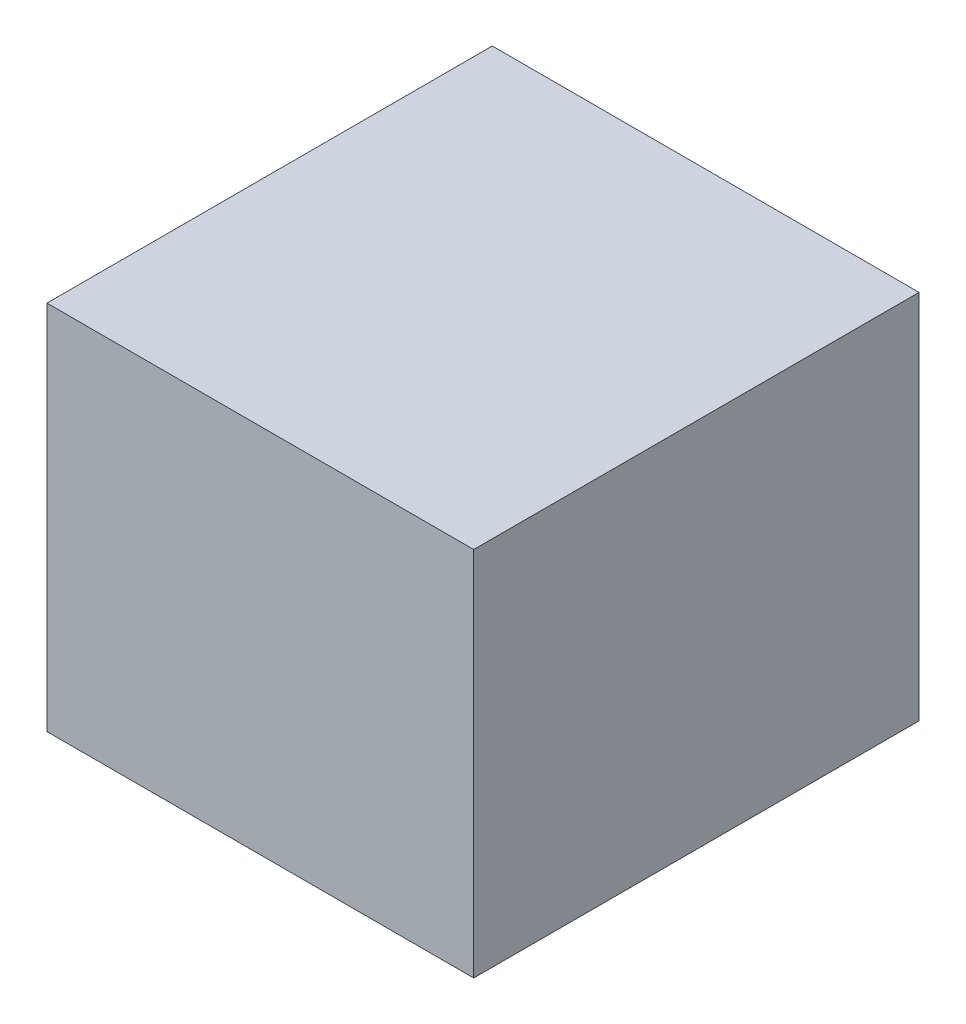
ISO-10303-21;
HEADER;
FILE_DESCRIPTION(('STEP AP214'),'2;1');
FILE_NAME('part.step','',(''),(''),'','','');
FILE_SCHEMA(('AUTOMOTIVE_DESIGN { 1 0 10303 214 1 1 1 1 }'));
ENDSEC;
DATA;
#1=APPLICATION_CONTEXT('core data for automotive mechanical design processes');
#2=APPLICATION_PROTOCOL_DEFINITION('international standard','automotive_design',2000,#1);
#3=PRODUCT_CONTEXT('',#1,'mechanical');
#4=PRODUCT('Part','Part','',(#3));
#5=PRODUCT_RELATED_PRODUCT_CATEGORY('part','',(#4));
#6=PRODUCT_DEFINITION_FORMATION('','',#4);
#7=PRODUCT_DEFINITION_CONTEXT('part definition',#1,'design');
#8=PRODUCT_DEFINITION('design','',#6,#7);
#9=PRODUCT_DEFINITION_SHAPE('','',#8);
#10=(LENGTH_UNIT() NAMED_UNIT(*) SI_UNIT(.MILLI.,.METRE.));
#11=(NAMED_UNIT(*) PLANE_ANGLE_UNIT() SI_UNIT($,.RADIAN.));
#12=(NAMED_UNIT(*) SI_UNIT($,.STERADIAN.) SOLID_ANGLE_UNIT());
#13=UNCERTAINTY_MEASURE_WITH_UNIT(LENGTH_MEASURE(1.E-05),#10,'distance_accuracy_value','');
#14=(GEOMETRIC_REPRESENTATION_CONTEXT(3) GLOBAL_UNCERTAINTY_ASSIGNED_CONTEXT((#13)) GLOBAL_UNIT_ASSIGNED_CONTEXT((#10,
#11,#12)) REPRESENTATION_CONTEXT('',''));
#15=CARTESIAN_POINT('',(0.,0.,0.));
#16=DIRECTION('',(0.,0.,1.));
#17=DIRECTION('',(1.,0.,0.));
#18=AXIS2_PLACEMENT_3D('',#15,#16,#17);
#19=CARTESIAN_POINT('',(287.5,250.,-300.));
#20=DIRECTION('',(0.,0.,1.));
#21=DIRECTION('',(0.,-1.,0.));
#22=AXIS2_PLACEMENT_3D('',#19,#20,#21);
#23=PLANE('',#22);
#24=DIRECTION('',(0.,1.,0.));
#25=VECTOR('',#24,1.);
#26=CARTESIAN_POINT('',(-287.5,250.,-300.));
#27=LINE('',#26,#25);
#28=CARTESIAN_POINT('',(-287.5,-250.,-300.));
#29=VERTEX_POINT('',#28);
#30=CARTESIAN_POINT('',(-287.5,250.,-300.));
#31=VERTEX_POINT('',#30);
#32=EDGE_CURVE('E96',#29,#31,#27,.T.);
#33=ORIENTED_EDGE('',*,*,#32,.T.);
#34=DIRECTION('',(-1.,0.,0.));
#35=VECTOR('',#34,1.);
#36=CARTESIAN_POINT('',(287.5,250.,-300.));
#37=LINE('',#36,#35);
#38=CARTESIAN_POINT('',(287.5,250.,-300.));
#39=VERTEX_POINT('',#38);
#40=EDGE_CURVE('E11',#39,#31,#37,.T.);
#41=ORIENTED_EDGE('',*,*,#40,.F.);
#42=DIRECTION('',(0.,1.,0.));
#43=VECTOR('',#42,1.);
#44=CARTESIAN_POINT('',(287.5,250.,-300.));
#45=LINE('',#44,#43);
#46=CARTESIAN_POINT('',(287.5,-250.,-300.));
#47=VERTEX_POINT('',#46);
#48=EDGE_CURVE('E84',#47,#39,#45,.T.);
#49=ORIENTED_EDGE('',*,*,#48,.F.);
#50=DIRECTION('',(-1.,0.,0.));
#51=VECTOR('',#50,1.);
#52=CARTESIAN_POINT('',(287.5,-250.,-300.));
#53=LINE('',#52,#51);
#54=EDGE_CURVE('E92',#47,#29,#53,.T.);
#55=ORIENTED_EDGE('',*,*,#54,.T.);
#56=EDGE_LOOP('',(#33,#41,#49,#55));
#57=FACE_BOUND('',#56,.T.);
#58=ADVANCED_FACE('F33',(#57),#23,.F.);
#59=CARTESIAN_POINT('',(287.5,250.,300.));
#60=DIRECTION('',(0.,-1.,0.));
#61=DIRECTION('',(0.,0.,-1.));
#62=AXIS2_PLACEMENT_3D('',#59,#60,#61);
#63=PLANE('',#62);
#64=DIRECTION('',(0.,0.,1.));
#65=VECTOR('',#64,1.);
#66=CARTESIAN_POINT('',(-287.5,250.,300.));
#67=LINE('',#66,#65);
#68=CARTESIAN_POINT('',(-287.5,250.,300.));
#69=VERTEX_POINT('',#68);
#70=EDGE_CURVE('E88',#31,#69,#67,.T.);
#71=ORIENTED_EDGE('',*,*,#70,.T.);
#72=DIRECTION('',(-1.,0.,0.));
#73=VECTOR('',#72,1.);
#74=CARTESIAN_POINT('',(287.5,250.,300.));
#75=LINE('',#74,#73);
#76=CARTESIAN_POINT('',(287.5,250.,300.));
#77=VERTEX_POINT('',#76);
#78=EDGE_CURVE('E41',#77,#69,#75,.T.);
#79=ORIENTED_EDGE('',*,*,#78,.F.);
#80=DIRECTION('',(0.,0.,1.));
#81=VECTOR('',#80,1.);
#82=CARTESIAN_POINT('',(287.5,250.,300.));
#83=LINE('',#82,#81);
#84=EDGE_CURVE('E79',#39,#77,#83,.T.);
#85=ORIENTED_EDGE('',*,*,#84,.F.);
#86=ORIENTED_EDGE('',*,*,#40,.T.);
#87=EDGE_LOOP('',(#71,#79,#85,#86));
#88=FACE_BOUND('',#87,.T.);
#89=ADVANCED_FACE('F87',(#88),#63,.F.);
#90=CARTESIAN_POINT('',(287.5,250.,300.));
#91=DIRECTION('',(0.,0.,-1.));
#92=DIRECTION('',(-1.,0.,0.));
#93=AXIS2_PLACEMENT_3D('',#90,#91,#92);
#94=PLANE('',#93);
#95=DIRECTION('',(0.,-1.,0.));
#96=VECTOR('',#95,1.);
#97=CARTESIAN_POINT('',(-287.5,250.,300.));
#98=LINE('',#97,#96);
#99=CARTESIAN_POINT('',(-287.5,-250.,300.));
#100=VERTEX_POINT('',#99);
#101=EDGE_CURVE('E66',#69,#100,#98,.T.);
#102=ORIENTED_EDGE('',*,*,#101,.T.);
#103=DIRECTION('',(-1.,0.,0.));
#104=VECTOR('',#103,1.);
#105=CARTESIAN_POINT('',(287.5,-250.,300.));
#106=LINE('',#105,#104);
#107=CARTESIAN_POINT('',(287.5,-250.,300.));
#108=VERTEX_POINT('',#107);
#109=EDGE_CURVE('E89',#108,#100,#106,.T.);
#110=ORIENTED_EDGE('',*,*,#109,.F.);
#111=DIRECTION('',(0.,-1.,0.));
#112=VECTOR('',#111,1.);
#113=CARTESIAN_POINT('',(287.5,250.,300.));
#114=LINE('',#113,#112);
#115=EDGE_CURVE('E82',#77,#108,#114,.T.);
#116=ORIENTED_EDGE('',*,*,#115,.F.);
#117=ORIENTED_EDGE('',*,*,#78,.T.);
#118=EDGE_LOOP('',(#102,#110,#116,#117));
#119=FACE_BOUND('',#118,.T.);
#120=ADVANCED_FACE('F90',(#119),#94,.F.);
#121=CARTESIAN_POINT('',(287.5,-250.,300.));
#122=DIRECTION('',(0.,1.,0.));
#123=DIRECTION('',(0.,0.,1.));
#124=AXIS2_PLACEMENT_3D('',#121,#122,#123);
#125=PLANE('',#124);
#126=DIRECTION('',(0.,0.,-1.));
#127=VECTOR('',#126,1.);
#128=CARTESIAN_POINT('',(-287.5,-250.,300.));
#129=LINE('',#128,#127);
#130=EDGE_CURVE('E72',#100,#29,#129,.T.);
#131=ORIENTED_EDGE('',*,*,#130,.T.);
#132=ORIENTED_EDGE('',*,*,#54,.F.);
#133=DIRECTION('',(0.,0.,-1.));
#134=VECTOR('',#133,1.);
#135=CARTESIAN_POINT('',(287.5,-250.,300.));
#136=LINE('',#135,#134);
#137=EDGE_CURVE('E49',#108,#47,#136,.T.);
#138=ORIENTED_EDGE('',*,*,#137,.F.);
#139=ORIENTED_EDGE('',*,*,#109,.T.);
#140=EDGE_LOOP('',(#131,#132,#138,#139));
#141=FACE_BOUND('',#140,.T.);
#142=ADVANCED_FACE('F103',(#141),#125,.F.);
#143=CARTESIAN_POINT('',(287.5,0.,0.));
#144=DIRECTION('',(1.,0.,0.));
#145=DIRECTION('',(0.,0.,-1.));
#146=AXIS2_PLACEMENT_3D('',#143,#144,#145);
#147=PLANE('',#146);
#148=ORIENTED_EDGE('',*,*,#48,.T.);
#149=ORIENTED_EDGE('',*,*,#84,.T.);
#150=ORIENTED_EDGE('',*,*,#115,.T.);
#151=ORIENTED_EDGE('',*,*,#137,.T.);
#152=EDGE_LOOP('',(#148,#149,#150,#151));
#153=FACE_BOUND('',#152,.T.);
#154=ADVANCED_FACE('F80',(#153),#147,.T.);
#155=CARTESIAN_POINT('',(-287.5,0.,0.));
#156=DIRECTION('',(1.,0.,0.));
#157=DIRECTION('',(0.,0.,-1.));
#158=AXIS2_PLACEMENT_3D('',#155,#156,#157);
#159=PLANE('',#158);
#160=ORIENTED_EDGE('',*,*,#32,.F.);
#161=ORIENTED_EDGE('',*,*,#130,.F.);
#162=ORIENTED_EDGE('',*,*,#101,.F.);
#163=ORIENTED_EDGE('',*,*,#70,.F.);
#164=EDGE_LOOP('',(#160,#161,#162,#163));
#165=FACE_BOUND('',#164,.T.);
#166=ADVANCED_FACE('F106',(#165),#159,.F.);
#167=CLOSED_SHELL('',(#58,#89,#120,#142,#154,#166));
#168=MANIFOLD_SOLID_BREP('B2',#167);
#169=ADVANCED_BREP_SHAPE_REPRESENTATION('',(#18,#168),#14);
#170=SHAPE_DEFINITION_REPRESENTATION(#9,#169);
ENDSEC;
END-ISO-10303-21;
